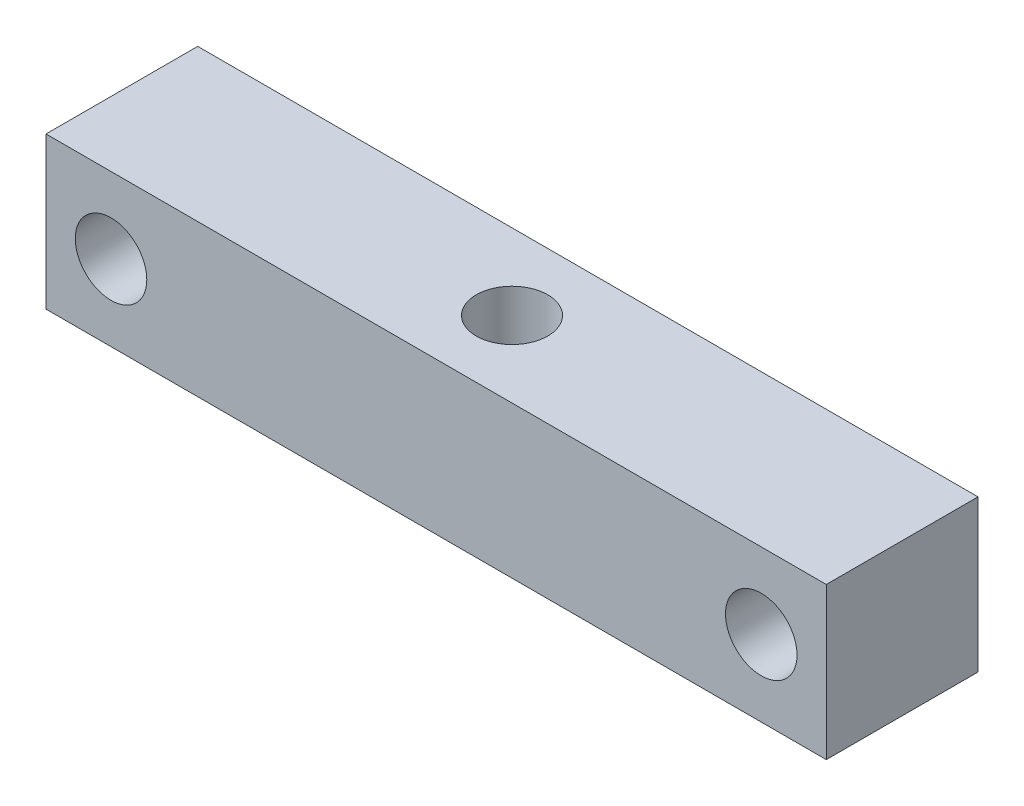
ISO-10303-21;
HEADER;
FILE_DESCRIPTION(('STEP AP214'),'2;1');
FILE_NAME('part.step','',(''),(''),'','','');
FILE_SCHEMA(('AUTOMOTIVE_DESIGN { 1 0 10303 214 1 1 1 1 }'));
ENDSEC;
DATA;
#1=APPLICATION_CONTEXT('core data for automotive mechanical design processes');
#2=APPLICATION_PROTOCOL_DEFINITION('international standard','automotive_design',2000,#1);
#3=PRODUCT_CONTEXT('',#1,'mechanical');
#4=PRODUCT('Part','Part','',(#3));
#5=PRODUCT_RELATED_PRODUCT_CATEGORY('part','',(#4));
#6=PRODUCT_DEFINITION_FORMATION('','',#4);
#7=PRODUCT_DEFINITION_CONTEXT('part definition',#1,'design');
#8=PRODUCT_DEFINITION('design','',#6,#7);
#9=PRODUCT_DEFINITION_SHAPE('','',#8);
#10=(LENGTH_UNIT() NAMED_UNIT(*) SI_UNIT(.MILLI.,.METRE.));
#11=(NAMED_UNIT(*) PLANE_ANGLE_UNIT() SI_UNIT($,.RADIAN.));
#12=(NAMED_UNIT(*) SI_UNIT($,.STERADIAN.) SOLID_ANGLE_UNIT());
#13=UNCERTAINTY_MEASURE_WITH_UNIT(LENGTH_MEASURE(1.E-05),#10,'distance_accuracy_value','');
#14=(GEOMETRIC_REPRESENTATION_CONTEXT(3) GLOBAL_UNCERTAINTY_ASSIGNED_CONTEXT((#13)) GLOBAL_UNIT_ASSIGNED_CONTEXT((#10,
#11,#12)) REPRESENTATION_CONTEXT('',''));
#15=CARTESIAN_POINT('',(0.,0.,0.));
#16=DIRECTION('',(0.,0.,1.));
#17=DIRECTION('',(1.,0.,0.));
#18=AXIS2_PLACEMENT_3D('',#15,#16,#17);
#19=CARTESIAN_POINT('',(0.,0.,3.5));
#20=DIRECTION('',(0.,0.,1.));
#21=DIRECTION('',(1.,0.,0.));
#22=AXIS2_PLACEMENT_3D('',#19,#20,#21);
#23=PLANE('',#22);
#24=CARTESIAN_POINT('',(-15.,0.,3.5));
#25=DIRECTION('',(0.,0.,1.));
#26=DIRECTION('',(1.,0.,0.));
#27=AXIS2_PLACEMENT_3D('',#24,#25,#26);
#28=CIRCLE('',#27,1.65);
#29=CARTESIAN_POINT('',(-13.35,0.,3.5));
#30=VERTEX_POINT('',#29);
#31=EDGE_CURVE('E122',#30,#30,#28,.T.);
#32=ORIENTED_EDGE('',*,*,#31,.F.);
#33=EDGE_LOOP('',(#32));
#34=FACE_BOUND('',#33,.T.);
#35=CARTESIAN_POINT('',(15.,0.,3.5));
#36=DIRECTION('',(0.,0.,1.));
#37=DIRECTION('',(1.,0.,0.));
#38=AXIS2_PLACEMENT_3D('',#35,#36,#37);
#39=CIRCLE('',#38,1.65);
#40=CARTESIAN_POINT('',(16.65,0.,3.5));
#41=VERTEX_POINT('',#40);
#42=EDGE_CURVE('E119',#41,#41,#39,.T.);
#43=ORIENTED_EDGE('',*,*,#42,.F.);
#44=EDGE_LOOP('',(#43));
#45=FACE_BOUND('',#44,.T.);
#46=DIRECTION('',(0.,-1.,0.));
#47=VECTOR('',#46,1.);
#48=CARTESIAN_POINT('',(-18.,-3.5,3.5));
#49=LINE('',#48,#47);
#50=CARTESIAN_POINT('',(-18.,3.5,3.5));
#51=VERTEX_POINT('',#50);
#52=CARTESIAN_POINT('',(-18.,-3.5,3.5));
#53=VERTEX_POINT('',#52);
#54=EDGE_CURVE('E90',#51,#53,#49,.T.);
#55=ORIENTED_EDGE('',*,*,#54,.T.);
#56=DIRECTION('',(1.,0.,0.));
#57=VECTOR('',#56,1.);
#58=CARTESIAN_POINT('',(18.,-3.5,3.5));
#59=LINE('',#58,#57);
#60=CARTESIAN_POINT('',(18.,-3.5,3.5));
#61=VERTEX_POINT('',#60);
#62=EDGE_CURVE('E86',#53,#61,#59,.T.);
#63=ORIENTED_EDGE('',*,*,#62,.T.);
#64=DIRECTION('',(0.,1.,0.));
#65=VECTOR('',#64,1.);
#66=CARTESIAN_POINT('',(18.,-3.5,3.5));
#67=LINE('',#66,#65);
#68=CARTESIAN_POINT('',(18.,3.5,3.5));
#69=VERTEX_POINT('',#68);
#70=EDGE_CURVE('E88',#61,#69,#67,.T.);
#71=ORIENTED_EDGE('',*,*,#70,.T.);
#72=DIRECTION('',(-1.,0.,0.));
#73=VECTOR('',#72,1.);
#74=CARTESIAN_POINT('',(18.,3.5,3.5));
#75=LINE('',#74,#73);
#76=EDGE_CURVE('E56',#69,#51,#75,.T.);
#77=ORIENTED_EDGE('',*,*,#76,.T.);
#78=EDGE_LOOP('',(#55,#63,#71,#77));
#79=FACE_BOUND('',#78,.T.);
#80=ADVANCED_FACE('F38',(#34,#45,#79),#23,.T.);
#81=CARTESIAN_POINT('',(0.,0.,-3.5));
#82=DIRECTION('',(0.,0.,1.));
#83=DIRECTION('',(1.,0.,0.));
#84=AXIS2_PLACEMENT_3D('',#81,#82,#83);
#85=PLANE('',#84);
#86=CARTESIAN_POINT('',(-15.,0.,-3.5));
#87=DIRECTION('',(0.,0.,1.));
#88=DIRECTION('',(1.,0.,0.));
#89=AXIS2_PLACEMENT_3D('',#86,#87,#88);
#90=CIRCLE('',#89,1.65);
#91=CARTESIAN_POINT('',(-13.35,0.,-3.5));
#92=VERTEX_POINT('',#91);
#93=EDGE_CURVE('E42',#92,#92,#90,.T.);
#94=ORIENTED_EDGE('',*,*,#93,.T.);
#95=EDGE_LOOP('',(#94));
#96=FACE_BOUND('',#95,.T.);
#97=CARTESIAN_POINT('',(15.,0.,-3.5));
#98=DIRECTION('',(0.,0.,1.));
#99=DIRECTION('',(1.,0.,0.));
#100=AXIS2_PLACEMENT_3D('',#97,#98,#99);
#101=CIRCLE('',#100,1.65);
#102=CARTESIAN_POINT('',(16.65,0.,-3.5));
#103=VERTEX_POINT('',#102);
#104=EDGE_CURVE('E106',#103,#103,#101,.T.);
#105=ORIENTED_EDGE('',*,*,#104,.T.);
#106=EDGE_LOOP('',(#105));
#107=FACE_BOUND('',#106,.T.);
#108=DIRECTION('',(0.,-1.,0.));
#109=VECTOR('',#108,1.);
#110=CARTESIAN_POINT('',(-18.,-3.5,-3.5));
#111=LINE('',#110,#109);
#112=CARTESIAN_POINT('',(-18.,3.5,-3.5));
#113=VERTEX_POINT('',#112);
#114=CARTESIAN_POINT('',(-18.,-3.5,-3.5));
#115=VERTEX_POINT('',#114);
#116=EDGE_CURVE('E103',#113,#115,#111,.T.);
#117=ORIENTED_EDGE('',*,*,#116,.F.);
#118=DIRECTION('',(-1.,0.,0.));
#119=VECTOR('',#118,1.);
#120=CARTESIAN_POINT('',(18.,3.5,-3.5));
#121=LINE('',#120,#119);
#122=CARTESIAN_POINT('',(18.,3.5,-3.5));
#123=VERTEX_POINT('',#122);
#124=EDGE_CURVE('E79',#123,#113,#121,.T.);
#125=ORIENTED_EDGE('',*,*,#124,.F.);
#126=DIRECTION('',(0.,1.,0.));
#127=VECTOR('',#126,1.);
#128=CARTESIAN_POINT('',(18.,-3.5,-3.5));
#129=LINE('',#128,#127);
#130=CARTESIAN_POINT('',(18.,-3.5,-3.5));
#131=VERTEX_POINT('',#130);
#132=EDGE_CURVE('E73',#131,#123,#129,.T.);
#133=ORIENTED_EDGE('',*,*,#132,.F.);
#134=DIRECTION('',(1.,0.,0.));
#135=VECTOR('',#134,1.);
#136=CARTESIAN_POINT('',(18.,-3.5,-3.5));
#137=LINE('',#136,#135);
#138=EDGE_CURVE('E94',#115,#131,#137,.T.);
#139=ORIENTED_EDGE('',*,*,#138,.F.);
#140=EDGE_LOOP('',(#117,#125,#133,#139));
#141=FACE_BOUND('',#140,.T.);
#142=ADVANCED_FACE('F114',(#96,#107,#141),#85,.F.);
#143=CARTESIAN_POINT('',(-18.,-3.5,3.5));
#144=DIRECTION('',(1.,0.,0.));
#145=DIRECTION('',(0.,0.,-1.));
#146=AXIS2_PLACEMENT_3D('',#143,#144,#145);
#147=PLANE('',#146);
#148=ORIENTED_EDGE('',*,*,#116,.T.);
#149=DIRECTION('',(0.,0.,-1.));
#150=VECTOR('',#149,1.);
#151=CARTESIAN_POINT('',(-18.,-3.5,3.5));
#152=LINE('',#151,#150);
#153=EDGE_CURVE('E11',#53,#115,#152,.T.);
#154=ORIENTED_EDGE('',*,*,#153,.F.);
#155=ORIENTED_EDGE('',*,*,#54,.F.);
#156=DIRECTION('',(0.,0.,-1.));
#157=VECTOR('',#156,1.);
#158=CARTESIAN_POINT('',(-18.,3.5,3.5));
#159=LINE('',#158,#157);
#160=EDGE_CURVE('E99',#51,#113,#159,.T.);
#161=ORIENTED_EDGE('',*,*,#160,.T.);
#162=EDGE_LOOP('',(#148,#154,#155,#161));
#163=FACE_BOUND('',#162,.T.);
#164=ADVANCED_FACE('F40',(#163),#147,.F.);
#165=CARTESIAN_POINT('',(18.,-3.5,3.5));
#166=DIRECTION('',(0.,1.,0.));
#167=DIRECTION('',(0.,0.,1.));
#168=AXIS2_PLACEMENT_3D('',#165,#166,#167);
#169=PLANE('',#168);
#170=CARTESIAN_POINT('',(0.,-3.5,0.));
#171=DIRECTION('',(0.,1.,0.));
#172=DIRECTION('',(0.,0.,1.));
#173=AXIS2_PLACEMENT_3D('',#170,#171,#172);
#174=CIRCLE('',#173,1.64999999999999);
#175=CARTESIAN_POINT('',(0.,-3.5,1.64999999999999));
#176=VERTEX_POINT('',#175);
#177=EDGE_CURVE('E125',#176,#176,#174,.T.);
#178=ORIENTED_EDGE('',*,*,#177,.T.);
#179=EDGE_LOOP('',(#178));
#180=FACE_BOUND('',#179,.T.);
#181=ORIENTED_EDGE('',*,*,#138,.T.);
#182=DIRECTION('',(0.,0.,-1.));
#183=VECTOR('',#182,1.);
#184=CARTESIAN_POINT('',(18.,-3.5,3.5));
#185=LINE('',#184,#183);
#186=EDGE_CURVE('E48',#61,#131,#185,.T.);
#187=ORIENTED_EDGE('',*,*,#186,.F.);
#188=ORIENTED_EDGE('',*,*,#62,.F.);
#189=ORIENTED_EDGE('',*,*,#153,.T.);
#190=EDGE_LOOP('',(#181,#187,#188,#189));
#191=FACE_BOUND('',#190,.T.);
#192=ADVANCED_FACE('F93',(#180,#191),#169,.F.);
#193=CARTESIAN_POINT('',(18.,-3.5,3.5));
#194=DIRECTION('',(-1.,0.,0.));
#195=DIRECTION('',(0.,0.,1.));
#196=AXIS2_PLACEMENT_3D('',#193,#194,#195);
#197=PLANE('',#196);
#198=ORIENTED_EDGE('',*,*,#132,.T.);
#199=DIRECTION('',(0.,0.,-1.));
#200=VECTOR('',#199,1.);
#201=CARTESIAN_POINT('',(18.,3.5,3.5));
#202=LINE('',#201,#200);
#203=EDGE_CURVE('E95',#69,#123,#202,.T.);
#204=ORIENTED_EDGE('',*,*,#203,.F.);
#205=ORIENTED_EDGE('',*,*,#70,.F.);
#206=ORIENTED_EDGE('',*,*,#186,.T.);
#207=EDGE_LOOP('',(#198,#204,#205,#206));
#208=FACE_BOUND('',#207,.T.);
#209=ADVANCED_FACE('F97',(#208),#197,.F.);
#210=CARTESIAN_POINT('',(18.,3.5,3.5));
#211=DIRECTION('',(0.,-1.,0.));
#212=DIRECTION('',(0.,0.,-1.));
#213=AXIS2_PLACEMENT_3D('',#210,#211,#212);
#214=PLANE('',#213);
#215=CARTESIAN_POINT('',(0.,3.5,0.));
#216=DIRECTION('',(0.,1.,0.));
#217=DIRECTION('',(0.,0.,1.));
#218=AXIS2_PLACEMENT_3D('',#215,#216,#217);
#219=CIRCLE('',#218,1.64999999999999);
#220=CARTESIAN_POINT('',(0.,3.5,1.64999999999999));
#221=VERTEX_POINT('',#220);
#222=EDGE_CURVE('E128',#221,#221,#219,.T.);
#223=ORIENTED_EDGE('',*,*,#222,.F.);
#224=EDGE_LOOP('',(#223));
#225=FACE_BOUND('',#224,.T.);
#226=ORIENTED_EDGE('',*,*,#124,.T.);
#227=ORIENTED_EDGE('',*,*,#160,.F.);
#228=ORIENTED_EDGE('',*,*,#76,.F.);
#229=ORIENTED_EDGE('',*,*,#203,.T.);
#230=EDGE_LOOP('',(#226,#227,#228,#229));
#231=FACE_BOUND('',#230,.T.);
#232=ADVANCED_FACE('F111',(#225,#231),#214,.F.);
#233=CARTESIAN_POINT('',(15.,0.,3.5));
#234=DIRECTION('',(0.,0.,1.));
#235=DIRECTION('',(1.,0.,0.));
#236=AXIS2_PLACEMENT_3D('',#233,#234,#235);
#237=CYLINDRICAL_SURFACE('',#236,1.65);
#238=ORIENTED_EDGE('',*,*,#42,.T.);
#239=EDGE_LOOP('',(#238));
#240=FACE_BOUND('',#239,.T.);
#241=ORIENTED_EDGE('',*,*,#104,.F.);
#242=EDGE_LOOP('',(#241));
#243=FACE_BOUND('',#242,.T.);
#244=ADVANCED_FACE('F136',(#240,#243),#237,.F.);
#245=CARTESIAN_POINT('',(-15.,0.,3.5));
#246=DIRECTION('',(0.,0.,1.));
#247=DIRECTION('',(1.,0.,0.));
#248=AXIS2_PLACEMENT_3D('',#245,#246,#247);
#249=CYLINDRICAL_SURFACE('',#248,1.65);
#250=ORIENTED_EDGE('',*,*,#31,.T.);
#251=EDGE_LOOP('',(#250));
#252=FACE_BOUND('',#251,.T.);
#253=ORIENTED_EDGE('',*,*,#93,.F.);
#254=EDGE_LOOP('',(#253));
#255=FACE_BOUND('',#254,.T.);
#256=ADVANCED_FACE('F142',(#252,#255),#249,.F.);
#257=CARTESIAN_POINT('',(0.,3.5,0.));
#258=DIRECTION('',(0.,1.,0.));
#259=DIRECTION('',(0.,0.,1.));
#260=AXIS2_PLACEMENT_3D('',#257,#258,#259);
#261=CYLINDRICAL_SURFACE('',#260,1.64999999999999);
#262=ORIENTED_EDGE('',*,*,#222,.T.);
#263=EDGE_LOOP('',(#262));
#264=FACE_BOUND('',#263,.T.);
#265=ORIENTED_EDGE('',*,*,#177,.F.);
#266=EDGE_LOOP('',(#265));
#267=FACE_BOUND('',#266,.T.);
#268=ADVANCED_FACE('F132',(#264,#267),#261,.F.);
#269=CLOSED_SHELL('',(#80,#142,#164,#192,#209,#232,#244,#256,#268));
#270=MANIFOLD_SOLID_BREP('B2',#269);
#271=ADVANCED_BREP_SHAPE_REPRESENTATION('',(#18,#270),#14);
#272=SHAPE_DEFINITION_REPRESENTATION(#9,#271);
ENDSEC;
END-ISO-10303-21;
